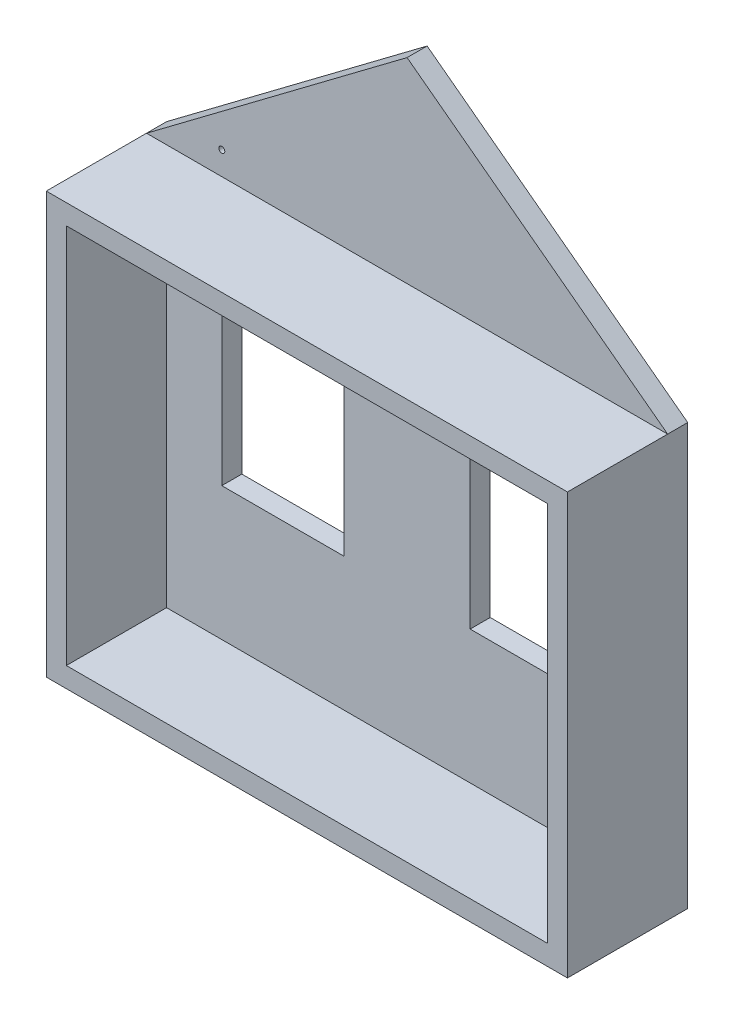
ISO-10303-21;
HEADER;
FILE_DESCRIPTION(('STEP AP214'),'2;1');
FILE_NAME('part.step','',(''),(''),'','','');
FILE_SCHEMA(('AUTOMOTIVE_DESIGN { 1 0 10303 214 1 1 1 1 }'));
ENDSEC;
DATA;
#1=APPLICATION_CONTEXT('core data for automotive mechanical design processes');
#2=APPLICATION_PROTOCOL_DEFINITION('international standard','automotive_design',2000,#1);
#3=PRODUCT_CONTEXT('',#1,'mechanical');
#4=PRODUCT('Part','Part','',(#3));
#5=PRODUCT_RELATED_PRODUCT_CATEGORY('part','',(#4));
#6=PRODUCT_DEFINITION_FORMATION('','',#4);
#7=PRODUCT_DEFINITION_CONTEXT('part definition',#1,'design');
#8=PRODUCT_DEFINITION('design','',#6,#7);
#9=PRODUCT_DEFINITION_SHAPE('','',#8);
#10=(LENGTH_UNIT() NAMED_UNIT(*) SI_UNIT(.MILLI.,.METRE.));
#11=(NAMED_UNIT(*) PLANE_ANGLE_UNIT() SI_UNIT($,.RADIAN.));
#12=(NAMED_UNIT(*) SI_UNIT($,.STERADIAN.) SOLID_ANGLE_UNIT());
#13=UNCERTAINTY_MEASURE_WITH_UNIT(LENGTH_MEASURE(1.E-05),#10,'distance_accuracy_value','');
#14=(GEOMETRIC_REPRESENTATION_CONTEXT(3) GLOBAL_UNCERTAINTY_ASSIGNED_CONTEXT((#13)) GLOBAL_UNIT_ASSIGNED_CONTEXT((#10,
#11,#12)) REPRESENTATION_CONTEXT('',''));
#15=CARTESIAN_POINT('',(0.,0.,0.));
#16=DIRECTION('',(0.,0.,1.));
#17=DIRECTION('',(1.,0.,0.));
#18=AXIS2_PLACEMENT_3D('',#15,#16,#17);
#19=CARTESIAN_POINT('',(0.,0.,500.));
#20=DIRECTION('',(0.,0.,1.));
#21=DIRECTION('',(1.,0.,0.));
#22=AXIS2_PLACEMENT_3D('',#19,#20,#21);
#23=PLANE('',#22);
#24=DIRECTION('',(0.,-1.,0.));
#25=VECTOR('',#24,1.);
#26=CARTESIAN_POINT('',(-50.,0.,500.));
#27=LINE('',#26,#25);
#28=CARTESIAN_POINT('',(-50.,2050.,500.));
#29=VERTEX_POINT('',#28);
#30=CARTESIAN_POINT('',(-50.,-50.,500.));
#31=VERTEX_POINT('',#30);
#32=EDGE_CURVE('E350',#29,#31,#27,.T.);
#33=ORIENTED_EDGE('',*,*,#32,.T.);
#34=DIRECTION('',(1.,0.,0.));
#35=VECTOR('',#34,1.);
#36=CARTESIAN_POINT('',(0.,-50.,500.));
#37=LINE('',#36,#35);
#38=CARTESIAN_POINT('',(2550.,-50.,500.));
#39=VERTEX_POINT('',#38);
#40=EDGE_CURVE('E353',#31,#39,#37,.T.);
#41=ORIENTED_EDGE('',*,*,#40,.T.);
#42=DIRECTION('',(0.,1.,0.));
#43=VECTOR('',#42,1.);
#44=CARTESIAN_POINT('',(2550.,0.,500.));
#45=LINE('',#44,#43);
#46=CARTESIAN_POINT('',(2550.,2050.,500.));
#47=VERTEX_POINT('',#46);
#48=EDGE_CURVE('E355',#39,#47,#45,.T.);
#49=ORIENTED_EDGE('',*,*,#48,.T.);
#50=DIRECTION('',(-1.,0.,0.));
#51=VECTOR('',#50,1.);
#52=CARTESIAN_POINT('',(0.,2050.,500.));
#53=LINE('',#52,#51);
#54=EDGE_CURVE('E357',#47,#29,#53,.T.);
#55=ORIENTED_EDGE('',*,*,#54,.T.);
#56=EDGE_LOOP('',(#33,#41,#49,#55));
#57=FACE_BOUND('',#56,.T.);
#58=DIRECTION('',(1.,0.,0.));
#59=VECTOR('',#58,1.);
#60=CARTESIAN_POINT('',(0.,50.,500.));
#61=LINE('',#60,#59);
#62=CARTESIAN_POINT('',(50.,50.,500.));
#63=VERTEX_POINT('',#62);
#64=CARTESIAN_POINT('',(2450.,50.,500.));
#65=VERTEX_POINT('',#64);
#66=EDGE_CURVE('E324',#63,#65,#61,.T.);
#67=ORIENTED_EDGE('',*,*,#66,.F.);
#68=DIRECTION('',(0.,-1.,0.));
#69=VECTOR('',#68,1.);
#70=CARTESIAN_POINT('',(50.,0.,500.));
#71=LINE('',#70,#69);
#72=CARTESIAN_POINT('',(50.,1950.,500.));
#73=VERTEX_POINT('',#72);
#74=EDGE_CURVE('E322',#73,#63,#71,.T.);
#75=ORIENTED_EDGE('',*,*,#74,.F.);
#76=DIRECTION('',(-1.,0.,0.));
#77=VECTOR('',#76,1.);
#78=CARTESIAN_POINT('',(0.,1950.,500.));
#79=LINE('',#78,#77);
#80=CARTESIAN_POINT('',(2450.,1950.,500.));
#81=VERTEX_POINT('',#80);
#82=EDGE_CURVE('E329',#81,#73,#79,.T.);
#83=ORIENTED_EDGE('',*,*,#82,.F.);
#84=DIRECTION('',(0.,1.,0.));
#85=VECTOR('',#84,1.);
#86=CARTESIAN_POINT('',(2450.,0.,500.));
#87=LINE('',#86,#85);
#88=EDGE_CURVE('E327',#65,#81,#87,.T.);
#89=ORIENTED_EDGE('',*,*,#88,.F.);
#90=EDGE_LOOP('',(#67,#75,#83,#89));
#91=FACE_BOUND('',#90,.T.);
#92=ADVANCED_FACE('F57',(#57,#91),#23,.T.);
#93=CARTESIAN_POINT('',(-50.,0.,500.));
#94=DIRECTION('',(1.,0.,0.));
#95=DIRECTION('',(0.,0.,-1.));
#96=AXIS2_PLACEMENT_3D('',#93,#94,#95);
#97=PLANE('',#96);
#98=DIRECTION('',(0.,0.,-1.));
#99=VECTOR('',#98,1.);
#100=CARTESIAN_POINT('',(-50.,2050.,500.));
#101=LINE('',#100,#99);
#102=CARTESIAN_POINT('',(-50.,2050.,0.));
#103=VERTEX_POINT('',#102);
#104=EDGE_CURVE('E359',#29,#103,#101,.T.);
#105=ORIENTED_EDGE('',*,*,#104,.T.);
#106=DIRECTION('',(0.,0.,1.));
#107=VECTOR('',#106,1.);
#108=CARTESIAN_POINT('',(-50.0000000000004,2050.,-100.));
#109=LINE('',#108,#107);
#110=CARTESIAN_POINT('',(-50.0000000000004,2050.,-100.));
#111=VERTEX_POINT('',#110);
#112=EDGE_CURVE('E315',#111,#103,#109,.T.);
#113=ORIENTED_EDGE('',*,*,#112,.F.);
#114=DIRECTION('',(0.,1.,0.));
#115=VECTOR('',#114,1.);
#116=CARTESIAN_POINT('',(-50.0000000000004,2050.,-100.));
#117=LINE('',#116,#115);
#118=CARTESIAN_POINT('',(-50.,-50.,-100.));
#119=VERTEX_POINT('',#118);
#120=EDGE_CURVE('E305',#119,#111,#117,.T.);
#121=ORIENTED_EDGE('',*,*,#120,.F.);
#122=DIRECTION('',(0.,0.,-1.));
#123=VECTOR('',#122,1.);
#124=CARTESIAN_POINT('',(-50.,-50.,500.));
#125=LINE('',#124,#123);
#126=EDGE_CURVE('E12',#31,#119,#125,.T.);
#127=ORIENTED_EDGE('',*,*,#126,.F.);
#128=ORIENTED_EDGE('',*,*,#32,.F.);
#129=EDGE_LOOP('',(#105,#113,#121,#127,#128));
#130=FACE_BOUND('',#129,.T.);
#131=ADVANCED_FACE('F59',(#130),#97,.F.);
#132=CARTESIAN_POINT('',(0.,-50.,500.));
#133=DIRECTION('',(0.,1.,0.));
#134=DIRECTION('',(0.,0.,1.));
#135=AXIS2_PLACEMENT_3D('',#132,#133,#134);
#136=PLANE('',#135);
#137=ORIENTED_EDGE('',*,*,#126,.T.);
#138=DIRECTION('',(-1.,0.,0.));
#139=VECTOR('',#138,1.);
#140=CARTESIAN_POINT('',(2550.,-49.9999999999998,-100.));
#141=LINE('',#140,#139);
#142=CARTESIAN_POINT('',(2550.,-49.9999999999998,-100.));
#143=VERTEX_POINT('',#142);
#144=EDGE_CURVE('E302',#143,#119,#141,.T.);
#145=ORIENTED_EDGE('',*,*,#144,.F.);
#146=DIRECTION('',(0.,0.,-1.));
#147=VECTOR('',#146,1.);
#148=CARTESIAN_POINT('',(2550.,-50.,500.));
#149=LINE('',#148,#147);
#150=EDGE_CURVE('E66',#39,#143,#149,.T.);
#151=ORIENTED_EDGE('',*,*,#150,.F.);
#152=ORIENTED_EDGE('',*,*,#40,.F.);
#153=EDGE_LOOP('',(#137,#145,#151,#152));
#154=FACE_BOUND('',#153,.T.);
#155=ADVANCED_FACE('F380',(#154),#136,.F.);
#156=CARTESIAN_POINT('',(2550.,0.,500.));
#157=DIRECTION('',(-1.,0.,0.));
#158=DIRECTION('',(0.,0.,1.));
#159=AXIS2_PLACEMENT_3D('',#156,#157,#158);
#160=PLANE('',#159);
#161=ORIENTED_EDGE('',*,*,#150,.T.);
#162=DIRECTION('',(0.,-1.,0.));
#163=VECTOR('',#162,1.);
#164=CARTESIAN_POINT('',(2550.,2050.,-100.));
#165=LINE('',#164,#163);
#166=CARTESIAN_POINT('',(2550.,2050.,-100.));
#167=VERTEX_POINT('',#166);
#168=EDGE_CURVE('E298',#167,#143,#165,.T.);
#169=ORIENTED_EDGE('',*,*,#168,.F.);
#170=DIRECTION('',(0.,0.,1.));
#171=VECTOR('',#170,1.);
#172=CARTESIAN_POINT('',(2550.,2050.,-100.));
#173=LINE('',#172,#171);
#174=CARTESIAN_POINT('',(2550.,2050.,0.));
#175=VERTEX_POINT('',#174);
#176=EDGE_CURVE('E318',#167,#175,#173,.T.);
#177=ORIENTED_EDGE('',*,*,#176,.T.);
#178=DIRECTION('',(0.,0.,-1.));
#179=VECTOR('',#178,1.);
#180=CARTESIAN_POINT('',(2550.,2050.,500.));
#181=LINE('',#180,#179);
#182=EDGE_CURVE('E364',#47,#175,#181,.T.);
#183=ORIENTED_EDGE('',*,*,#182,.F.);
#184=ORIENTED_EDGE('',*,*,#48,.F.);
#185=EDGE_LOOP('',(#161,#169,#177,#183,#184));
#186=FACE_BOUND('',#185,.T.);
#187=ADVANCED_FACE('F370',(#186),#160,.F.);
#188=CARTESIAN_POINT('',(0.,2050.,500.));
#189=DIRECTION('',(0.,-1.,0.));
#190=DIRECTION('',(0.,0.,-1.));
#191=AXIS2_PLACEMENT_3D('',#188,#189,#190);
#192=PLANE('',#191);
#193=DIRECTION('',(-1.,0.,0.));
#194=VECTOR('',#193,1.);
#195=CARTESIAN_POINT('',(0.,2050.,0.));
#196=LINE('',#195,#194);
#197=EDGE_CURVE('E349',#175,#103,#196,.T.);
#198=ORIENTED_EDGE('',*,*,#197,.T.);
#199=ORIENTED_EDGE('',*,*,#104,.F.);
#200=ORIENTED_EDGE('',*,*,#54,.F.);
#201=ORIENTED_EDGE('',*,*,#182,.T.);
#202=EDGE_LOOP('',(#198,#199,#200,#201));
#203=FACE_BOUND('',#202,.T.);
#204=ADVANCED_FACE('F395',(#203),#192,.F.);
#205=CARTESIAN_POINT('',(50.,0.,500.));
#206=DIRECTION('',(1.,0.,0.));
#207=DIRECTION('',(0.,0.,-1.));
#208=AXIS2_PLACEMENT_3D('',#205,#206,#207);
#209=PLANE('',#208);
#210=DIRECTION('',(0.,-1.,0.));
#211=VECTOR('',#210,1.);
#212=CARTESIAN_POINT('',(50.,0.,0.));
#213=LINE('',#212,#211);
#214=CARTESIAN_POINT('',(50.,1950.,0.));
#215=VERTEX_POINT('',#214);
#216=CARTESIAN_POINT('',(50.,50.,0.));
#217=VERTEX_POINT('',#216);
#218=EDGE_CURVE('E321',#215,#217,#213,.T.);
#219=ORIENTED_EDGE('',*,*,#218,.F.);
#220=DIRECTION('',(0.,0.,-1.));
#221=VECTOR('',#220,1.);
#222=CARTESIAN_POINT('',(50.,1950.,500.));
#223=LINE('',#222,#221);
#224=EDGE_CURVE('E331',#73,#215,#223,.T.);
#225=ORIENTED_EDGE('',*,*,#224,.F.);
#226=ORIENTED_EDGE('',*,*,#74,.T.);
#227=DIRECTION('',(0.,0.,-1.));
#228=VECTOR('',#227,1.);
#229=CARTESIAN_POINT('',(50.,50.,500.));
#230=LINE('',#229,#228);
#231=EDGE_CURVE('E346',#63,#217,#230,.T.);
#232=ORIENTED_EDGE('',*,*,#231,.T.);
#233=EDGE_LOOP('',(#219,#225,#226,#232));
#234=FACE_BOUND('',#233,.T.);
#235=ADVANCED_FACE('F416',(#234),#209,.T.);
#236=CARTESIAN_POINT('',(0.,50.,500.));
#237=DIRECTION('',(0.,1.,0.));
#238=DIRECTION('',(0.,0.,1.));
#239=AXIS2_PLACEMENT_3D('',#236,#237,#238);
#240=PLANE('',#239);
#241=DIRECTION('',(1.,0.,0.));
#242=VECTOR('',#241,1.);
#243=CARTESIAN_POINT('',(0.,50.,0.));
#244=LINE('',#243,#242);
#245=CARTESIAN_POINT('',(2450.,50.,0.));
#246=VERTEX_POINT('',#245);
#247=EDGE_CURVE('E334',#217,#246,#244,.T.);
#248=ORIENTED_EDGE('',*,*,#247,.F.);
#249=ORIENTED_EDGE('',*,*,#231,.F.);
#250=ORIENTED_EDGE('',*,*,#66,.T.);
#251=DIRECTION('',(0.,0.,-1.));
#252=VECTOR('',#251,1.);
#253=CARTESIAN_POINT('',(2450.,50.,500.));
#254=LINE('',#253,#252);
#255=EDGE_CURVE('E344',#65,#246,#254,.T.);
#256=ORIENTED_EDGE('',*,*,#255,.T.);
#257=EDGE_LOOP('',(#248,#249,#250,#256));
#258=FACE_BOUND('',#257,.T.);
#259=ADVANCED_FACE('F407',(#258),#240,.T.);
#260=CARTESIAN_POINT('',(2450.,0.,500.));
#261=DIRECTION('',(-1.,0.,0.));
#262=DIRECTION('',(0.,0.,1.));
#263=AXIS2_PLACEMENT_3D('',#260,#261,#262);
#264=PLANE('',#263);
#265=DIRECTION('',(0.,1.,0.));
#266=VECTOR('',#265,1.);
#267=CARTESIAN_POINT('',(2450.,0.,0.));
#268=LINE('',#267,#266);
#269=CARTESIAN_POINT('',(2450.,1950.,0.));
#270=VERTEX_POINT('',#269);
#271=EDGE_CURVE('E337',#246,#270,#268,.T.);
#272=ORIENTED_EDGE('',*,*,#271,.F.);
#273=ORIENTED_EDGE('',*,*,#255,.F.);
#274=ORIENTED_EDGE('',*,*,#88,.T.);
#275=DIRECTION('',(0.,0.,-1.));
#276=VECTOR('',#275,1.);
#277=CARTESIAN_POINT('',(2450.,1950.,500.));
#278=LINE('',#277,#276);
#279=EDGE_CURVE('E81',#81,#270,#278,.T.);
#280=ORIENTED_EDGE('',*,*,#279,.T.);
#281=EDGE_LOOP('',(#272,#273,#274,#280));
#282=FACE_BOUND('',#281,.T.);
#283=ADVANCED_FACE('F410',(#282),#264,.T.);
#284=CARTESIAN_POINT('',(0.,1950.,500.));
#285=DIRECTION('',(0.,-1.,0.));
#286=DIRECTION('',(0.,0.,-1.));
#287=AXIS2_PLACEMENT_3D('',#284,#285,#286);
#288=PLANE('',#287);
#289=DIRECTION('',(-1.,0.,0.));
#290=VECTOR('',#289,1.);
#291=CARTESIAN_POINT('',(0.,1950.,0.));
#292=LINE('',#291,#290);
#293=EDGE_CURVE('E325',#270,#215,#292,.T.);
#294=ORIENTED_EDGE('',*,*,#293,.F.);
#295=ORIENTED_EDGE('',*,*,#279,.F.);
#296=ORIENTED_EDGE('',*,*,#82,.T.);
#297=ORIENTED_EDGE('',*,*,#224,.T.);
#298=EDGE_LOOP('',(#294,#295,#296,#297));
#299=FACE_BOUND('',#298,.T.);
#300=ADVANCED_FACE('F418',(#299),#288,.T.);
#301=CARTESIAN_POINT('',(0.,0.,0.));
#302=DIRECTION('',(0.,0.,1.));
#303=DIRECTION('',(1.,0.,0.));
#304=AXIS2_PLACEMENT_3D('',#301,#302,#303);
#305=PLANE('',#304);
#306=CARTESIAN_POINT('',(325.534447993456,2166.16635153722,0.));
#307=DIRECTION('',(0.,0.,-1.));
#308=DIRECTION('',(-1.,0.,0.));
#309=AXIS2_PLACEMENT_3D('',#306,#307,#308);
#310=CIRCLE('',#309,15.);
#311=CARTESIAN_POINT('',(310.534447993456,2166.16635153722,0.));
#312=VERTEX_POINT('',#311);
#313=EDGE_CURVE('E229',#312,#312,#310,.T.);
#314=ORIENTED_EDGE('',*,*,#313,.T.);
#315=EDGE_LOOP('',(#314));
#316=FACE_BOUND('',#315,.T.);
#317=ORIENTED_EDGE('',*,*,#197,.F.);
#318=DIRECTION('',(0.799472546418132,-0.60070262819777,0.));
#319=VECTOR('',#318,1.);
#320=CARTESIAN_POINT('',(1250.,3026.78578227085,0.));
#321=LINE('',#320,#319);
#322=CARTESIAN_POINT('',(1250.,3026.78578227085,0.));
#323=VERTEX_POINT('',#322);
#324=EDGE_CURVE('E294',#323,#175,#321,.T.);
#325=ORIENTED_EDGE('',*,*,#324,.F.);
#326=DIRECTION('',(0.799472546418132,0.60070262819777,0.));
#327=VECTOR('',#326,1.);
#328=CARTESIAN_POINT('',(-50.0000000000004,2050.,0.));
#329=LINE('',#328,#327);
#330=EDGE_CURVE('E299',#103,#323,#329,.T.);
#331=ORIENTED_EDGE('',*,*,#330,.F.);
#332=EDGE_LOOP('',(#317,#325,#331));
#333=FACE_BOUND('',#332,.T.);
#334=ADVANCED_FACE('F420',(#316,#333),#305,.T.);
#335=CARTESIAN_POINT('',(0.,0.,-100.));
#336=DIRECTION('',(0.,0.,1.));
#337=DIRECTION('',(1.,0.,0.));
#338=AXIS2_PLACEMENT_3D('',#335,#336,#337);
#339=PLANE('',#338);
#340=DIRECTION('',(0.809588574453255,0.586997734335275,0.));
#341=VECTOR('',#340,1.);
#342=CARTESIAN_POINT('',(1259.95874580334,2935.63681826689,-100.));
#343=LINE('',#342,#341);
#344=CARTESIAN_POINT('',(89.2076372040148,2086.77571782161,-100.));
#345=VERTEX_POINT('',#344);
#346=CARTESIAN_POINT('',(1259.95874580334,2935.63681826689,-100.));
#347=VERTEX_POINT('',#346);
#348=EDGE_CURVE('E220',#345,#347,#343,.T.);
#349=ORIENTED_EDGE('',*,*,#348,.F.);
#350=DIRECTION('',(-1.,0.,0.));
#351=VECTOR('',#350,1.);
#352=CARTESIAN_POINT('',(89.2076372040149,2086.77571782161,-100.));
#353=LINE('',#352,#351);
#354=CARTESIAN_POINT('',(2379.00027416146,2086.77571782161,-100.));
#355=VERTEX_POINT('',#354);
#356=EDGE_CURVE('E73',#355,#345,#353,.T.);
#357=ORIENTED_EDGE('',*,*,#356,.F.);
#358=DIRECTION('',(0.796714223766311,-0.604356224133122,0.));
#359=VECTOR('',#358,1.);
#360=CARTESIAN_POINT('',(2379.00027416146,2086.77571782161,-100.));
#361=LINE('',#360,#359);
#362=EDGE_CURVE('E217',#347,#355,#361,.T.);
#363=ORIENTED_EDGE('',*,*,#362,.F.);
#364=EDGE_LOOP('',(#349,#357,#363));
#365=FACE_BOUND('',#364,.T.);
#366=DIRECTION('',(1.,0.,0.));
#367=VECTOR('',#366,1.);
#368=CARTESIAN_POINT('',(1564.68307952263,1631.58450549727,-100.));
#369=LINE('',#368,#367);
#370=CARTESIAN_POINT('',(1564.68307952263,1631.58450549727,-100.));
#371=VERTEX_POINT('',#370);
#372=CARTESIAN_POINT('',(2174.46555200654,1631.58450549727,-100.));
#373=VERTEX_POINT('',#372);
#374=EDGE_CURVE('E264',#371,#373,#369,.T.);
#375=ORIENTED_EDGE('',*,*,#374,.F.);
#376=DIRECTION('',(0.,1.,0.));
#377=VECTOR('',#376,1.);
#378=CARTESIAN_POINT('',(1564.68307952263,1631.58450549727,-100.));
#379=LINE('',#378,#377);
#380=CARTESIAN_POINT('',(1564.68307952263,714.956365769845,-100.));
#381=VERTEX_POINT('',#380);
#382=EDGE_CURVE('E272',#381,#371,#379,.T.);
#383=ORIENTED_EDGE('',*,*,#382,.F.);
#384=DIRECTION('',(-1.,0.,0.));
#385=VECTOR('',#384,1.);
#386=CARTESIAN_POINT('',(1564.68307952263,714.956365769845,-100.));
#387=LINE('',#386,#385);
#388=CARTESIAN_POINT('',(2174.46555200654,714.956365769845,-100.));
#389=VERTEX_POINT('',#388);
#390=EDGE_CURVE('E269',#389,#381,#387,.T.);
#391=ORIENTED_EDGE('',*,*,#390,.F.);
#392=DIRECTION('',(0.,-1.,0.));
#393=VECTOR('',#392,1.);
#394=CARTESIAN_POINT('',(2174.46555200654,1631.58450549727,-100.));
#395=LINE('',#394,#393);
#396=EDGE_CURVE('E266',#373,#389,#395,.T.);
#397=ORIENTED_EDGE('',*,*,#396,.F.);
#398=EDGE_LOOP('',(#375,#383,#391,#397));
#399=FACE_BOUND('',#398,.T.);
#400=DIRECTION('',(0.799472546418132,-0.60070262819777,0.));
#401=VECTOR('',#400,1.);
#402=CARTESIAN_POINT('',(1250.,3026.78578227085,-100.));
#403=LINE('',#402,#401);
#404=CARTESIAN_POINT('',(1250.,3026.78578227085,-100.));
#405=VERTEX_POINT('',#404);
#406=EDGE_CURVE('E295',#405,#167,#403,.T.);
#407=ORIENTED_EDGE('',*,*,#406,.T.);
#408=ORIENTED_EDGE('',*,*,#168,.T.);
#409=ORIENTED_EDGE('',*,*,#144,.T.);
#410=ORIENTED_EDGE('',*,*,#120,.T.);
#411=DIRECTION('',(0.799472546418132,0.60070262819777,0.));
#412=VECTOR('',#411,1.);
#413=CARTESIAN_POINT('',(-50.0000000000004,2050.,-100.));
#414=LINE('',#413,#412);
#415=EDGE_CURVE('E307',#111,#405,#414,.T.);
#416=ORIENTED_EDGE('',*,*,#415,.T.);
#417=EDGE_LOOP('',(#407,#408,#409,#410,#416));
#418=FACE_BOUND('',#417,.T.);
#419=DIRECTION('',(0.,-1.,0.));
#420=VECTOR('',#419,1.);
#421=CARTESIAN_POINT('',(935.316920477369,1631.58450549727,-100.));
#422=LINE('',#421,#420);
#423=CARTESIAN_POINT('',(935.316920477369,1631.58450549727,-100.));
#424=VERTEX_POINT('',#423);
#425=CARTESIAN_POINT('',(935.316920477368,714.956365769845,-100.));
#426=VERTEX_POINT('',#425);
#427=EDGE_CURVE('E233',#424,#426,#422,.T.);
#428=ORIENTED_EDGE('',*,*,#427,.F.);
#429=DIRECTION('',(1.,0.,0.));
#430=VECTOR('',#429,1.);
#431=CARTESIAN_POINT('',(935.316920477369,1631.58450549727,-100.));
#432=LINE('',#431,#430);
#433=CARTESIAN_POINT('',(325.534447993456,1631.58450549727,-100.));
#434=VERTEX_POINT('',#433);
#435=EDGE_CURVE('E241',#434,#424,#432,.T.);
#436=ORIENTED_EDGE('',*,*,#435,.F.);
#437=DIRECTION('',(0.,1.,0.));
#438=VECTOR('',#437,1.);
#439=CARTESIAN_POINT('',(325.534447993456,1631.58450549727,-100.));
#440=LINE('',#439,#438);
#441=CARTESIAN_POINT('',(325.534447993456,714.956365769845,-100.));
#442=VERTEX_POINT('',#441);
#443=EDGE_CURVE('E238',#442,#434,#440,.T.);
#444=ORIENTED_EDGE('',*,*,#443,.F.);
#445=DIRECTION('',(-1.,0.,0.));
#446=VECTOR('',#445,1.);
#447=CARTESIAN_POINT('',(935.316920477368,714.956365769845,-100.));
#448=LINE('',#447,#446);
#449=EDGE_CURVE('E235',#426,#442,#448,.T.);
#450=ORIENTED_EDGE('',*,*,#449,.F.);
#451=EDGE_LOOP('',(#428,#436,#444,#450));
#452=FACE_BOUND('',#451,.T.);
#453=ADVANCED_FACE('F375',(#365,#399,#418,#452),#339,.F.);
#454=ORIENTED_EDGE('',*,*,#293,.T.);
#455=ORIENTED_EDGE('',*,*,#218,.T.);
#456=ORIENTED_EDGE('',*,*,#247,.T.);
#457=ORIENTED_EDGE('',*,*,#271,.T.);
#458=EDGE_LOOP('',(#454,#455,#456,#457));
#459=FACE_BOUND('',#458,.T.);
#460=DIRECTION('',(1.,0.,0.));
#461=VECTOR('',#460,1.);
#462=CARTESIAN_POINT('',(935.316920477369,1631.58450549727,0.));
#463=LINE('',#462,#461);
#464=CARTESIAN_POINT('',(325.534447993456,1631.58450549727,0.));
#465=VERTEX_POINT('',#464);
#466=CARTESIAN_POINT('',(935.316920477369,1631.58450549727,0.));
#467=VERTEX_POINT('',#466);
#468=EDGE_CURVE('E236',#465,#467,#463,.T.);
#469=ORIENTED_EDGE('',*,*,#468,.T.);
#470=DIRECTION('',(0.,-1.,0.));
#471=VECTOR('',#470,1.);
#472=CARTESIAN_POINT('',(935.316920477369,1631.58450549727,0.));
#473=LINE('',#472,#471);
#474=CARTESIAN_POINT('',(935.316920477368,714.956365769845,0.));
#475=VERTEX_POINT('',#474);
#476=EDGE_CURVE('E232',#467,#475,#473,.T.);
#477=ORIENTED_EDGE('',*,*,#476,.T.);
#478=DIRECTION('',(-1.,0.,0.));
#479=VECTOR('',#478,1.);
#480=CARTESIAN_POINT('',(935.316920477368,714.956365769845,0.));
#481=LINE('',#480,#479);
#482=CARTESIAN_POINT('',(325.534447993456,714.956365769845,0.));
#483=VERTEX_POINT('',#482);
#484=EDGE_CURVE('E246',#475,#483,#481,.T.);
#485=ORIENTED_EDGE('',*,*,#484,.T.);
#486=DIRECTION('',(0.,1.,0.));
#487=VECTOR('',#486,1.);
#488=CARTESIAN_POINT('',(325.534447993456,1631.58450549727,0.));
#489=LINE('',#488,#487);
#490=EDGE_CURVE('E249',#483,#465,#489,.T.);
#491=ORIENTED_EDGE('',*,*,#490,.T.);
#492=EDGE_LOOP('',(#469,#477,#485,#491));
#493=FACE_BOUND('',#492,.T.);
#494=DIRECTION('',(0.,1.,0.));
#495=VECTOR('',#494,1.);
#496=CARTESIAN_POINT('',(1564.68307952263,1631.58450549727,0.));
#497=LINE('',#496,#495);
#498=CARTESIAN_POINT('',(1564.68307952263,714.956365769845,0.));
#499=VERTEX_POINT('',#498);
#500=CARTESIAN_POINT('',(1564.68307952263,1631.58450549727,0.));
#501=VERTEX_POINT('',#500);
#502=EDGE_CURVE('E267',#499,#501,#497,.T.);
#503=ORIENTED_EDGE('',*,*,#502,.T.);
#504=DIRECTION('',(1.,0.,0.));
#505=VECTOR('',#504,1.);
#506=CARTESIAN_POINT('',(1564.68307952263,1631.58450549727,0.));
#507=LINE('',#506,#505);
#508=CARTESIAN_POINT('',(2174.46555200654,1631.58450549727,0.));
#509=VERTEX_POINT('',#508);
#510=EDGE_CURVE('E263',#501,#509,#507,.T.);
#511=ORIENTED_EDGE('',*,*,#510,.T.);
#512=DIRECTION('',(0.,-1.,0.));
#513=VECTOR('',#512,1.);
#514=CARTESIAN_POINT('',(2174.46555200654,1631.58450549727,0.));
#515=LINE('',#514,#513);
#516=CARTESIAN_POINT('',(2174.46555200654,714.956365769845,0.));
#517=VERTEX_POINT('',#516);
#518=EDGE_CURVE('E277',#509,#517,#515,.T.);
#519=ORIENTED_EDGE('',*,*,#518,.T.);
#520=DIRECTION('',(-1.,0.,0.));
#521=VECTOR('',#520,1.);
#522=CARTESIAN_POINT('',(1564.68307952263,714.956365769845,0.));
#523=LINE('',#522,#521);
#524=EDGE_CURVE('E280',#517,#499,#523,.T.);
#525=ORIENTED_EDGE('',*,*,#524,.T.);
#526=EDGE_LOOP('',(#503,#511,#519,#525));
#527=FACE_BOUND('',#526,.T.);
#528=ADVANCED_FACE('F412',(#459,#493,#527),#305,.T.);
#529=CARTESIAN_POINT('',(1250.,3026.78578227085,-100.));
#530=DIRECTION('',(-0.60070262819777,-0.799472546418132,0.));
#531=DIRECTION('',(0.799472546418132,-0.60070262819777,0.));
#532=AXIS2_PLACEMENT_3D('',#529,#530,#531);
#533=PLANE('',#532);
#534=ORIENTED_EDGE('',*,*,#324,.T.);
#535=ORIENTED_EDGE('',*,*,#176,.F.);
#536=ORIENTED_EDGE('',*,*,#406,.F.);
#537=DIRECTION('',(0.,0.,1.));
#538=VECTOR('',#537,1.);
#539=CARTESIAN_POINT('',(1250.,3026.78578227085,-100.));
#540=LINE('',#539,#538);
#541=EDGE_CURVE('E309',#405,#323,#540,.T.);
#542=ORIENTED_EDGE('',*,*,#541,.T.);
#543=EDGE_LOOP('',(#534,#535,#536,#542));
#544=FACE_BOUND('',#543,.T.);
#545=ADVANCED_FACE('F391',(#544),#533,.F.);
#546=CARTESIAN_POINT('',(-50.0000000000004,2050.,-100.));
#547=DIRECTION('',(0.60070262819777,-0.799472546418132,0.));
#548=DIRECTION('',(0.799472546418132,0.60070262819777,0.));
#549=AXIS2_PLACEMENT_3D('',#546,#547,#548);
#550=PLANE('',#549);
#551=ORIENTED_EDGE('',*,*,#330,.T.);
#552=ORIENTED_EDGE('',*,*,#541,.F.);
#553=ORIENTED_EDGE('',*,*,#415,.F.);
#554=ORIENTED_EDGE('',*,*,#112,.T.);
#555=EDGE_LOOP('',(#551,#552,#553,#554));
#556=FACE_BOUND('',#555,.T.);
#557=ADVANCED_FACE('F388',(#556),#550,.F.);
#558=CARTESIAN_POINT('',(1564.68307952263,1631.58450549727,-100.));
#559=DIRECTION('',(0.,-1.,0.));
#560=DIRECTION('',(0.,0.,-1.));
#561=AXIS2_PLACEMENT_3D('',#558,#559,#560);
#562=PLANE('',#561);
#563=ORIENTED_EDGE('',*,*,#510,.F.);
#564=DIRECTION('',(0.,0.,1.));
#565=VECTOR('',#564,1.);
#566=CARTESIAN_POINT('',(1564.68307952263,1631.58450549727,-100.));
#567=LINE('',#566,#565);
#568=EDGE_CURVE('E274',#371,#501,#567,.T.);
#569=ORIENTED_EDGE('',*,*,#568,.F.);
#570=ORIENTED_EDGE('',*,*,#374,.T.);
#571=DIRECTION('',(0.,0.,1.));
#572=VECTOR('',#571,1.);
#573=CARTESIAN_POINT('',(2174.46555200654,1631.58450549727,-100.));
#574=LINE('',#573,#572);
#575=EDGE_CURVE('E291',#373,#509,#574,.T.);
#576=ORIENTED_EDGE('',*,*,#575,.T.);
#577=EDGE_LOOP('',(#563,#569,#570,#576));
#578=FACE_BOUND('',#577,.T.);
#579=ADVANCED_FACE('F522',(#578),#562,.T.);
#580=CARTESIAN_POINT('',(2174.46555200654,1631.58450549727,-100.));
#581=DIRECTION('',(-1.,0.,0.));
#582=DIRECTION('',(0.,0.,1.));
#583=AXIS2_PLACEMENT_3D('',#580,#581,#582);
#584=PLANE('',#583);
#585=ORIENTED_EDGE('',*,*,#518,.F.);
#586=ORIENTED_EDGE('',*,*,#575,.F.);
#587=ORIENTED_EDGE('',*,*,#396,.T.);
#588=DIRECTION('',(0.,0.,1.));
#589=VECTOR('',#588,1.);
#590=CARTESIAN_POINT('',(2174.46555200654,714.956365769845,-100.));
#591=LINE('',#590,#589);
#592=EDGE_CURVE('E289',#389,#517,#591,.T.);
#593=ORIENTED_EDGE('',*,*,#592,.T.);
#594=EDGE_LOOP('',(#585,#586,#587,#593));
#595=FACE_BOUND('',#594,.T.);
#596=ADVANCED_FACE('F530',(#595),#584,.T.);
#597=CARTESIAN_POINT('',(1564.68307952263,714.956365769845,-100.));
#598=DIRECTION('',(0.,1.,0.));
#599=DIRECTION('',(0.,0.,1.));
#600=AXIS2_PLACEMENT_3D('',#597,#598,#599);
#601=PLANE('',#600);
#602=ORIENTED_EDGE('',*,*,#524,.F.);
#603=ORIENTED_EDGE('',*,*,#592,.F.);
#604=ORIENTED_EDGE('',*,*,#390,.T.);
#605=DIRECTION('',(0.,0.,1.));
#606=VECTOR('',#605,1.);
#607=CARTESIAN_POINT('',(1564.68307952263,714.956365769845,-100.));
#608=LINE('',#607,#606);
#609=EDGE_CURVE('E287',#381,#499,#608,.T.);
#610=ORIENTED_EDGE('',*,*,#609,.T.);
#611=EDGE_LOOP('',(#602,#603,#604,#610));
#612=FACE_BOUND('',#611,.T.);
#613=ADVANCED_FACE('F540',(#612),#601,.T.);
#614=CARTESIAN_POINT('',(1564.68307952263,1631.58450549727,-100.));
#615=DIRECTION('',(1.,0.,0.));
#616=DIRECTION('',(0.,0.,-1.));
#617=AXIS2_PLACEMENT_3D('',#614,#615,#616);
#618=PLANE('',#617);
#619=ORIENTED_EDGE('',*,*,#502,.F.);
#620=ORIENTED_EDGE('',*,*,#609,.F.);
#621=ORIENTED_EDGE('',*,*,#382,.T.);
#622=ORIENTED_EDGE('',*,*,#568,.T.);
#623=EDGE_LOOP('',(#619,#620,#621,#622));
#624=FACE_BOUND('',#623,.T.);
#625=ADVANCED_FACE('F550',(#624),#618,.T.);
#626=CARTESIAN_POINT('',(935.316920477369,1631.58450549727,-100.));
#627=DIRECTION('',(-1.,0.,0.));
#628=DIRECTION('',(0.,-1.,0.));
#629=AXIS2_PLACEMENT_3D('',#626,#627,#628);
#630=PLANE('',#629);
#631=ORIENTED_EDGE('',*,*,#476,.F.);
#632=DIRECTION('',(0.,0.,1.));
#633=VECTOR('',#632,1.);
#634=CARTESIAN_POINT('',(935.316920477369,1631.58450549727,-100.));
#635=LINE('',#634,#633);
#636=EDGE_CURVE('E243',#424,#467,#635,.T.);
#637=ORIENTED_EDGE('',*,*,#636,.F.);
#638=ORIENTED_EDGE('',*,*,#427,.T.);
#639=DIRECTION('',(0.,0.,1.));
#640=VECTOR('',#639,1.);
#641=CARTESIAN_POINT('',(935.316920477368,714.956365769845,-100.));
#642=LINE('',#641,#640);
#643=EDGE_CURVE('E260',#426,#475,#642,.T.);
#644=ORIENTED_EDGE('',*,*,#643,.T.);
#645=EDGE_LOOP('',(#631,#637,#638,#644));
#646=FACE_BOUND('',#645,.T.);
#647=ADVANCED_FACE('F560',(#646),#630,.T.);
#648=CARTESIAN_POINT('',(935.316920477368,714.956365769845,-100.));
#649=DIRECTION('',(0.,1.,0.));
#650=DIRECTION('',(0.,0.,1.));
#651=AXIS2_PLACEMENT_3D('',#648,#649,#650);
#652=PLANE('',#651);
#653=ORIENTED_EDGE('',*,*,#484,.F.);
#654=ORIENTED_EDGE('',*,*,#643,.F.);
#655=ORIENTED_EDGE('',*,*,#449,.T.);
#656=DIRECTION('',(0.,0.,1.));
#657=VECTOR('',#656,1.);
#658=CARTESIAN_POINT('',(325.534447993456,714.956365769845,-100.));
#659=LINE('',#658,#657);
#660=EDGE_CURVE('E258',#442,#483,#659,.T.);
#661=ORIENTED_EDGE('',*,*,#660,.T.);
#662=EDGE_LOOP('',(#653,#654,#655,#661));
#663=FACE_BOUND('',#662,.T.);
#664=ADVANCED_FACE('F570',(#663),#652,.T.);
#665=CARTESIAN_POINT('',(325.534447993456,1631.58450549727,-100.));
#666=DIRECTION('',(1.,0.,0.));
#667=DIRECTION('',(0.,1.,0.));
#668=AXIS2_PLACEMENT_3D('',#665,#666,#667);
#669=PLANE('',#668);
#670=ORIENTED_EDGE('',*,*,#490,.F.);
#671=ORIENTED_EDGE('',*,*,#660,.F.);
#672=ORIENTED_EDGE('',*,*,#443,.T.);
#673=DIRECTION('',(0.,0.,1.));
#674=VECTOR('',#673,1.);
#675=CARTESIAN_POINT('',(325.534447993456,1631.58450549727,-100.));
#676=LINE('',#675,#674);
#677=EDGE_CURVE('E256',#434,#465,#676,.T.);
#678=ORIENTED_EDGE('',*,*,#677,.T.);
#679=EDGE_LOOP('',(#670,#671,#672,#678));
#680=FACE_BOUND('',#679,.T.);
#681=ADVANCED_FACE('F580',(#680),#669,.T.);
#682=CARTESIAN_POINT('',(935.316920477369,1631.58450549727,-100.));
#683=DIRECTION('',(0.,-1.,0.));
#684=DIRECTION('',(0.,0.,-1.));
#685=AXIS2_PLACEMENT_3D('',#682,#683,#684);
#686=PLANE('',#685);
#687=ORIENTED_EDGE('',*,*,#468,.F.);
#688=ORIENTED_EDGE('',*,*,#677,.F.);
#689=ORIENTED_EDGE('',*,*,#435,.T.);
#690=ORIENTED_EDGE('',*,*,#636,.T.);
#691=EDGE_LOOP('',(#687,#688,#689,#690));
#692=FACE_BOUND('',#691,.T.);
#693=ADVANCED_FACE('F590',(#692),#686,.T.);
#694=CARTESIAN_POINT('',(325.534447993456,2166.16635153722,-100.));
#695=DIRECTION('',(0.,0.,1.));
#696=DIRECTION('',(1.,0.,0.));
#697=AXIS2_PLACEMENT_3D('',#694,#695,#696);
#698=CYLINDRICAL_SURFACE('',#697,15.);
#699=CARTESIAN_POINT('',(325.534447993456,2166.16635153722,-30.));
#700=DIRECTION('',(0.,0.,1.));
#701=DIRECTION('',(1.,0.,0.));
#702=AXIS2_PLACEMENT_3D('',#699,#700,#701);
#703=CIRCLE('',#702,15.);
#704=CARTESIAN_POINT('',(340.534447993456,2166.16635153722,-30.));
#705=VERTEX_POINT('',#704);
#706=EDGE_CURVE('E61',#705,#705,#703,.T.);
#707=ORIENTED_EDGE('',*,*,#706,.F.);
#708=EDGE_LOOP('',(#707));
#709=FACE_BOUND('',#708,.T.);
#710=ORIENTED_EDGE('',*,*,#313,.F.);
#711=EDGE_LOOP('',(#710));
#712=FACE_BOUND('',#711,.T.);
#713=ADVANCED_FACE('F600',(#709,#712),#698,.F.);
#714=CARTESIAN_POINT('',(89.2076372040149,2086.77571782161,-30.));
#715=DIRECTION('',(0.,-1.,0.));
#716=DIRECTION('',(0.,0.,-1.));
#717=AXIS2_PLACEMENT_3D('',#714,#715,#716);
#718=PLANE('',#717);
#719=ORIENTED_EDGE('',*,*,#356,.T.);
#720=DIRECTION('',(0.,0.,-1.));
#721=VECTOR('',#720,1.);
#722=CARTESIAN_POINT('',(89.2076372040149,2086.77571782161,-30.));
#723=LINE('',#722,#721);
#724=CARTESIAN_POINT('',(89.2076372040149,2086.77571782161,-30.));
#725=VERTEX_POINT('',#724);
#726=EDGE_CURVE('E198',#725,#345,#723,.T.);
#727=ORIENTED_EDGE('',*,*,#726,.F.);
#728=DIRECTION('',(-1.,0.,0.));
#729=VECTOR('',#728,1.);
#730=CARTESIAN_POINT('',(89.2076372040149,2086.77571782161,-30.));
#731=LINE('',#730,#729);
#732=CARTESIAN_POINT('',(2379.00027416146,2086.77571782161,-30.));
#733=VERTEX_POINT('',#732);
#734=EDGE_CURVE('E202',#733,#725,#731,.T.);
#735=ORIENTED_EDGE('',*,*,#734,.F.);
#736=DIRECTION('',(0.,0.,-1.));
#737=VECTOR('',#736,1.);
#738=CARTESIAN_POINT('',(2379.00027416146,2086.77571782161,-30.));
#739=LINE('',#738,#737);
#740=EDGE_CURVE('E226',#733,#355,#739,.T.);
#741=ORIENTED_EDGE('',*,*,#740,.T.);
#742=EDGE_LOOP('',(#719,#727,#735,#741));
#743=FACE_BOUND('',#742,.T.);
#744=ADVANCED_FACE('F200',(#743),#718,.F.);
#745=CARTESIAN_POINT('',(2379.00027416146,2086.77571782161,-30.));
#746=DIRECTION('',(0.604356224133122,0.796714223766311,0.));
#747=DIRECTION('',(-0.796714223766311,0.604356224133122,0.));
#748=AXIS2_PLACEMENT_3D('',#745,#746,#747);
#749=PLANE('',#748);
#750=ORIENTED_EDGE('',*,*,#362,.T.);
#751=ORIENTED_EDGE('',*,*,#740,.F.);
#752=DIRECTION('',(0.796714223766311,-0.604356224133122,0.));
#753=VECTOR('',#752,1.);
#754=CARTESIAN_POINT('',(2379.00027416146,2086.77571782161,-30.));
#755=LINE('',#754,#753);
#756=CARTESIAN_POINT('',(1259.95874580334,2935.63681826689,-30.));
#757=VERTEX_POINT('',#756);
#758=EDGE_CURVE('E208',#757,#733,#755,.T.);
#759=ORIENTED_EDGE('',*,*,#758,.F.);
#760=DIRECTION('',(0.,0.,-1.));
#761=VECTOR('',#760,1.);
#762=CARTESIAN_POINT('',(1259.95874580334,2935.63681826689,-30.));
#763=LINE('',#762,#761);
#764=EDGE_CURVE('E207',#757,#347,#763,.T.);
#765=ORIENTED_EDGE('',*,*,#764,.T.);
#766=EDGE_LOOP('',(#750,#751,#759,#765));
#767=FACE_BOUND('',#766,.T.);
#768=ADVANCED_FACE('F622',(#767),#749,.F.);
#769=CARTESIAN_POINT('',(1259.95874580334,2935.63681826689,-30.));
#770=DIRECTION('',(-0.586997734335275,0.809588574453255,0.));
#771=DIRECTION('',(-0.809588574453255,-0.586997734335275,0.));
#772=AXIS2_PLACEMENT_3D('',#769,#770,#771);
#773=PLANE('',#772);
#774=ORIENTED_EDGE('',*,*,#348,.T.);
#775=ORIENTED_EDGE('',*,*,#764,.F.);
#776=DIRECTION('',(0.809588574453255,0.586997734335275,0.));
#777=VECTOR('',#776,1.);
#778=CARTESIAN_POINT('',(1259.95874580334,2935.63681826689,-30.));
#779=LINE('',#778,#777);
#780=EDGE_CURVE('E211',#725,#757,#779,.T.);
#781=ORIENTED_EDGE('',*,*,#780,.F.);
#782=ORIENTED_EDGE('',*,*,#726,.T.);
#783=EDGE_LOOP('',(#774,#775,#781,#782));
#784=FACE_BOUND('',#783,.T.);
#785=ADVANCED_FACE('F212',(#784),#773,.F.);
#786=CARTESIAN_POINT('',(0.,0.,-30.));
#787=DIRECTION('',(0.,0.,1.));
#788=DIRECTION('',(1.,0.,0.));
#789=AXIS2_PLACEMENT_3D('',#786,#787,#788);
#790=PLANE('',#789);
#791=ORIENTED_EDGE('',*,*,#706,.T.);
#792=EDGE_LOOP('',(#791));
#793=FACE_BOUND('',#792,.T.);
#794=ORIENTED_EDGE('',*,*,#734,.T.);
#795=ORIENTED_EDGE('',*,*,#780,.T.);
#796=ORIENTED_EDGE('',*,*,#758,.T.);
#797=EDGE_LOOP('',(#794,#795,#796));
#798=FACE_BOUND('',#797,.T.);
#799=ADVANCED_FACE('F216',(#793,#798),#790,.F.);
#800=CLOSED_SHELL('',(#92,#131,#155,#187,#204,#235,#259,#283,#300,#334,#453,#528,#545,#557,#579,
#596,#613,#625,#647,#664,#681,#693,#713,#744,#768,#785,#799));
#801=MANIFOLD_SOLID_BREP('B2',#800);
#802=ADVANCED_BREP_SHAPE_REPRESENTATION('',(#18,#801),#14);
#803=SHAPE_DEFINITION_REPRESENTATION(#9,#802);
ENDSEC;
END-ISO-10303-21;
